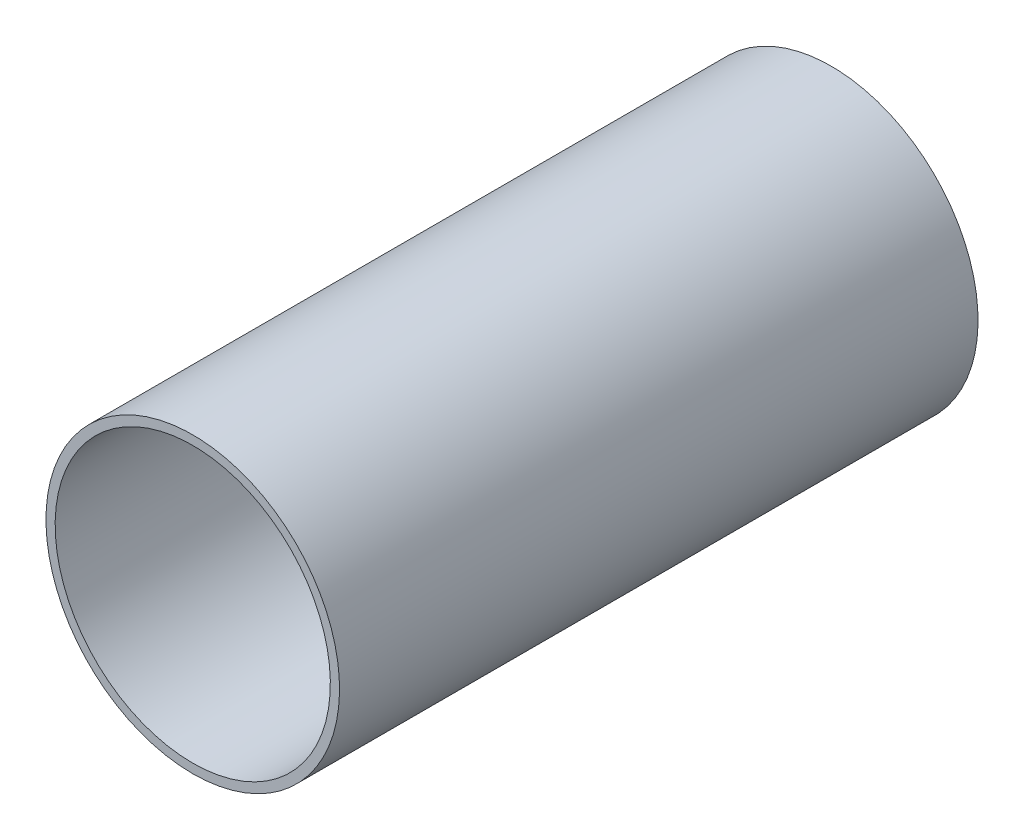
ISO-10303-21;
HEADER;
FILE_DESCRIPTION(('STEP AP214'),'2;1');
FILE_NAME('part.step','',(''),(''),'','','');
FILE_SCHEMA(('AUTOMOTIVE_DESIGN { 1 0 10303 214 1 1 1 1 }'));
ENDSEC;
DATA;
#1=APPLICATION_CONTEXT('core data for automotive mechanical design processes');
#2=APPLICATION_PROTOCOL_DEFINITION('international standard','automotive_design',2000,#1);
#3=PRODUCT_CONTEXT('',#1,'mechanical');
#4=PRODUCT('Part','Part','',(#3));
#5=PRODUCT_RELATED_PRODUCT_CATEGORY('part','',(#4));
#6=PRODUCT_DEFINITION_FORMATION('','',#4);
#7=PRODUCT_DEFINITION_CONTEXT('part definition',#1,'design');
#8=PRODUCT_DEFINITION('design','',#6,#7);
#9=PRODUCT_DEFINITION_SHAPE('','',#8);
#10=(LENGTH_UNIT() NAMED_UNIT(*) SI_UNIT(.MILLI.,.METRE.));
#11=(NAMED_UNIT(*) PLANE_ANGLE_UNIT() SI_UNIT($,.RADIAN.));
#12=(NAMED_UNIT(*) SI_UNIT($,.STERADIAN.) SOLID_ANGLE_UNIT());
#13=UNCERTAINTY_MEASURE_WITH_UNIT(LENGTH_MEASURE(1.E-05),#10,'distance_accuracy_value','');
#14=(GEOMETRIC_REPRESENTATION_CONTEXT(3) GLOBAL_UNCERTAINTY_ASSIGNED_CONTEXT((#13)) GLOBAL_UNIT_ASSIGNED_CONTEXT((#10,
#11,#12)) REPRESENTATION_CONTEXT('',''));
#15=CARTESIAN_POINT('',(0.,0.,0.));
#16=DIRECTION('',(0.,0.,1.));
#17=DIRECTION('',(1.,0.,0.));
#18=AXIS2_PLACEMENT_3D('',#15,#16,#17);
#19=CARTESIAN_POINT('',(146.304,-73.152,-0.045));
#20=DIRECTION('',(0.,0.,-1.));
#21=DIRECTION('',(0.,-1.,0.));
#22=AXIS2_PLACEMENT_3D('',#19,#20,#21);
#23=CYLINDRICAL_SURFACE('',#22,0.375);
#24=CARTESIAN_POINT('',(146.304,-73.152,-0.035));
#25=DIRECTION('',(0.,0.,-1.));
#26=DIRECTION('',(0.,-1.,0.));
#27=AXIS2_PLACEMENT_3D('',#24,#25,#26);
#28=CIRCLE('',#27,0.375);
#29=CARTESIAN_POINT('',(146.304,-73.527,-0.035));
#30=VERTEX_POINT('',#29);
#31=EDGE_CURVE('E63',#30,#30,#28,.T.);
#32=ORIENTED_EDGE('',*,*,#31,.T.);
#33=DIRECTION('',(0.,0.,1.));
#34=VECTOR('',#33,1.);
#35=CARTESIAN_POINT('',(146.304,-73.527,-0.045));
#36=LINE('',#35,#34);
#37=CARTESIAN_POINT('',(146.304,-73.527,1.705));
#38=VERTEX_POINT('',#37);
#39=EDGE_CURVE('E11',#30,#38,#36,.T.);
#40=ORIENTED_EDGE('',*,*,#39,.T.);
#41=CARTESIAN_POINT('',(146.304,-73.152,1.705));
#42=DIRECTION('',(0.,0.,-1.));
#43=DIRECTION('',(0.,-1.,0.));
#44=AXIS2_PLACEMENT_3D('',#41,#42,#43);
#45=CIRCLE('',#44,0.375);
#46=EDGE_CURVE('E25',#38,#38,#45,.T.);
#47=ORIENTED_EDGE('',*,*,#46,.F.);
#48=ORIENTED_EDGE('',*,*,#39,.F.);
#49=EDGE_LOOP('',(#32,#40,#47,#48));
#50=FACE_BOUND('',#49,.T.);
#51=ADVANCED_FACE('F17',(#50),#23,.F.);
#52=CARTESIAN_POINT('',(146.304,-73.552,1.705));
#53=DIRECTION('',(0.,0.,1.));
#54=DIRECTION('',(1.,0.,0.));
#55=AXIS2_PLACEMENT_3D('',#52,#53,#54);
#56=PLANE('',#55);
#57=ORIENTED_EDGE('',*,*,#46,.T.);
#58=EDGE_LOOP('',(#57));
#59=FACE_BOUND('',#58,.T.);
#60=CARTESIAN_POINT('',(146.304,-73.152,1.705));
#61=DIRECTION('',(0.,0.,1.));
#62=DIRECTION('',(0.,-1.,0.));
#63=AXIS2_PLACEMENT_3D('',#60,#61,#62);
#64=CIRCLE('',#63,0.4);
#65=CARTESIAN_POINT('',(146.304,-73.552,1.705));
#66=VERTEX_POINT('',#65);
#67=EDGE_CURVE('E55',#66,#66,#64,.T.);
#68=ORIENTED_EDGE('',*,*,#67,.T.);
#69=EDGE_LOOP('',(#68));
#70=FACE_BOUND('',#69,.T.);
#71=ADVANCED_FACE('F72',(#59,#70),#56,.T.);
#72=CARTESIAN_POINT('',(146.304,-73.552,-0.035));
#73=DIRECTION('',(0.,0.,1.));
#74=DIRECTION('',(1.,0.,0.));
#75=AXIS2_PLACEMENT_3D('',#72,#73,#74);
#76=PLANE('',#75);
#77=ORIENTED_EDGE('',*,*,#31,.F.);
#78=EDGE_LOOP('',(#77));
#79=FACE_BOUND('',#78,.T.);
#80=CARTESIAN_POINT('',(146.304,-73.152,-0.035));
#81=DIRECTION('',(0.,0.,1.));
#82=DIRECTION('',(0.,-1.,0.));
#83=AXIS2_PLACEMENT_3D('',#80,#81,#82);
#84=CIRCLE('',#83,0.4);
#85=CARTESIAN_POINT('',(146.304,-73.552,-0.035));
#86=VERTEX_POINT('',#85);
#87=EDGE_CURVE('E54',#86,#86,#84,.T.);
#88=ORIENTED_EDGE('',*,*,#87,.F.);
#89=EDGE_LOOP('',(#88));
#90=FACE_BOUND('',#89,.T.);
#91=ADVANCED_FACE('F81',(#79,#90),#76,.F.);
#92=CARTESIAN_POINT('',(146.304,-73.152,-0.035));
#93=DIRECTION('',(0.,0.,-1.));
#94=DIRECTION('',(0.,-1.,0.));
#95=AXIS2_PLACEMENT_3D('',#92,#93,#94);
#96=CYLINDRICAL_SURFACE('',#95,0.4);
#97=ORIENTED_EDGE('',*,*,#87,.T.);
#98=DIRECTION('',(0.,0.,1.));
#99=VECTOR('',#98,1.);
#100=CARTESIAN_POINT('',(146.304,-73.552,-0.035));
#101=LINE('',#100,#99);
#102=EDGE_CURVE('E51',#86,#66,#101,.T.);
#103=ORIENTED_EDGE('',*,*,#102,.T.);
#104=ORIENTED_EDGE('',*,*,#67,.F.);
#105=ORIENTED_EDGE('',*,*,#102,.F.);
#106=EDGE_LOOP('',(#97,#103,#104,#105));
#107=FACE_BOUND('',#106,.T.);
#108=ADVANCED_FACE('F52',(#107),#96,.T.);
#109=CLOSED_SHELL('',(#51,#71,#91,#108));
#110=MANIFOLD_SOLID_BREP('B1',#109);
#111=ADVANCED_BREP_SHAPE_REPRESENTATION('',(#18,#110),#14);
#112=SHAPE_DEFINITION_REPRESENTATION(#9,#111);
ENDSEC;
END-ISO-10303-21;
